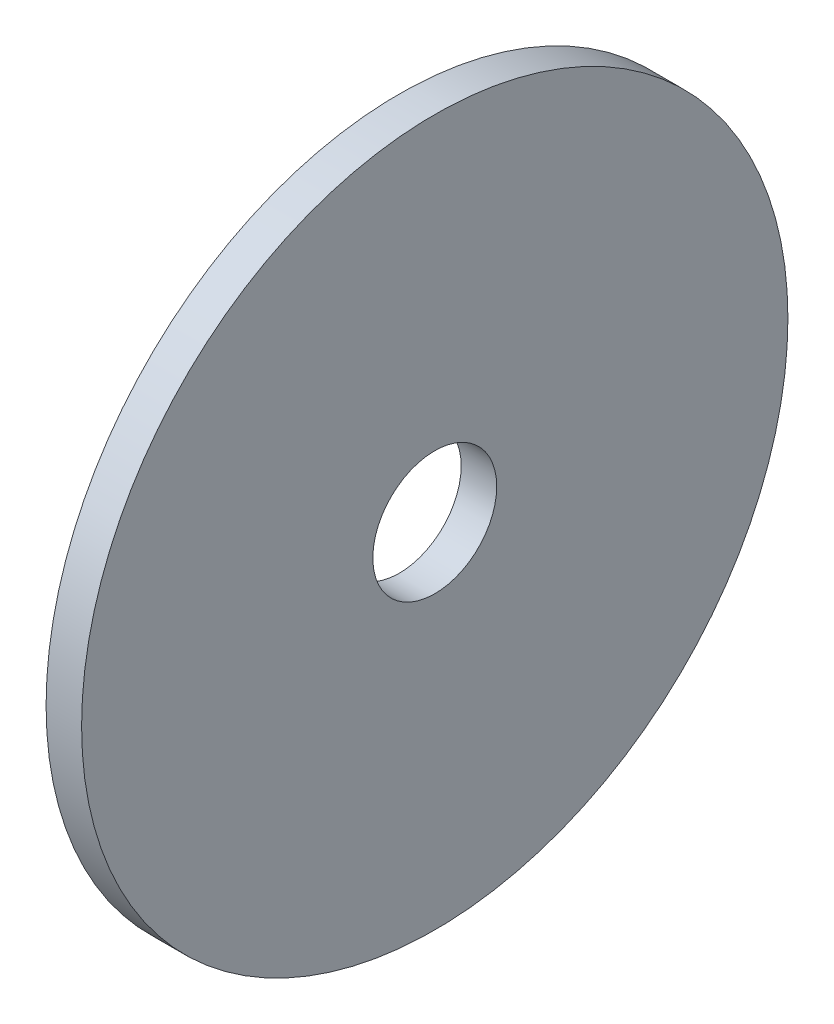
ISO-10303-21;
HEADER;
FILE_DESCRIPTION(('STEP AP214'),'2;1');
FILE_NAME('part.step','',(''),(''),'','','');
FILE_SCHEMA(('AUTOMOTIVE_DESIGN { 1 0 10303 214 1 1 1 1 }'));
ENDSEC;
DATA;
#1=APPLICATION_CONTEXT('core data for automotive mechanical design processes');
#2=APPLICATION_PROTOCOL_DEFINITION('international standard','automotive_design',2000,#1);
#3=PRODUCT_CONTEXT('',#1,'mechanical');
#4=PRODUCT('Part','Part','',(#3));
#5=PRODUCT_RELATED_PRODUCT_CATEGORY('part','',(#4));
#6=PRODUCT_DEFINITION_FORMATION('','',#4);
#7=PRODUCT_DEFINITION_CONTEXT('part definition',#1,'design');
#8=PRODUCT_DEFINITION('design','',#6,#7);
#9=PRODUCT_DEFINITION_SHAPE('','',#8);
#10=(LENGTH_UNIT() NAMED_UNIT(*) SI_UNIT(.MILLI.,.METRE.));
#11=(NAMED_UNIT(*) PLANE_ANGLE_UNIT() SI_UNIT($,.RADIAN.));
#12=(NAMED_UNIT(*) SI_UNIT($,.STERADIAN.) SOLID_ANGLE_UNIT());
#13=UNCERTAINTY_MEASURE_WITH_UNIT(LENGTH_MEASURE(1.E-05),#10,'distance_accuracy_value','');
#14=(GEOMETRIC_REPRESENTATION_CONTEXT(3) GLOBAL_UNCERTAINTY_ASSIGNED_CONTEXT((#13)) GLOBAL_UNIT_ASSIGNED_CONTEXT((#10,
#11,#12)) REPRESENTATION_CONTEXT('',''));
#15=CARTESIAN_POINT('',(0.,0.,0.));
#16=DIRECTION('',(0.,0.,1.));
#17=DIRECTION('',(1.,0.,0.));
#18=AXIS2_PLACEMENT_3D('',#15,#16,#17);
#19=CARTESIAN_POINT('',(509.651,0.,0.));
#20=DIRECTION('',(1.,0.,0.));
#21=DIRECTION('',(0.,0.,-1.));
#22=AXIS2_PLACEMENT_3D('',#19,#20,#21);
#23=PLANE('',#22);
#24=CARTESIAN_POINT('',(509.651,0.,0.));
#25=DIRECTION('',(1.,0.,0.));
#26=DIRECTION('',(0.,0.,-1.));
#27=AXIS2_PLACEMENT_3D('',#24,#25,#26);
#28=CIRCLE('',#27,9.525);
#29=CARTESIAN_POINT('',(509.651,0.,-9.525));
#30=VERTEX_POINT('',#29);
#31=EDGE_CURVE('E59',#30,#30,#28,.T.);
#32=ORIENTED_EDGE('',*,*,#31,.T.);
#33=EDGE_LOOP('',(#32));
#34=FACE_BOUND('',#33,.T.);
#35=CARTESIAN_POINT('',(509.651,0.,0.));
#36=DIRECTION('',(1.,0.,0.));
#37=DIRECTION('',(0.,0.,-1.));
#38=AXIS2_PLACEMENT_3D('',#35,#36,#37);
#39=CIRCLE('',#38,54.303329995861);
#40=CARTESIAN_POINT('',(509.651,0.,-54.303329995861));
#41=VERTEX_POINT('',#40);
#42=EDGE_CURVE('E11',#41,#41,#39,.T.);
#43=ORIENTED_EDGE('',*,*,#42,.F.);
#44=EDGE_LOOP('',(#43));
#45=FACE_BOUND('',#44,.T.);
#46=ADVANCED_FACE('F46',(#34,#45),#23,.F.);
#47=CARTESIAN_POINT('',(509.651,0.,0.));
#48=DIRECTION('',(1.,0.,0.));
#49=DIRECTION('',(0.,0.,-1.));
#50=AXIS2_PLACEMENT_3D('',#47,#48,#49);
#51=CYLINDRICAL_SURFACE('',#50,54.303329995861);
#52=ORIENTED_EDGE('',*,*,#42,.T.);
#53=EDGE_LOOP('',(#52));
#54=FACE_BOUND('',#53,.T.);
#55=CARTESIAN_POINT('',(515.112,0.,0.));
#56=DIRECTION('',(1.,0.,0.));
#57=DIRECTION('',(0.,0.,-1.));
#58=AXIS2_PLACEMENT_3D('',#55,#56,#57);
#59=CIRCLE('',#58,54.303329995861);
#60=CARTESIAN_POINT('',(515.112,0.,-54.303329995861));
#61=VERTEX_POINT('',#60);
#62=EDGE_CURVE('E50',#61,#61,#59,.T.);
#63=ORIENTED_EDGE('',*,*,#62,.F.);
#64=EDGE_LOOP('',(#63));
#65=FACE_BOUND('',#64,.T.);
#66=ADVANCED_FACE('F79',(#54,#65),#51,.T.);
#67=CARTESIAN_POINT('',(515.112,0.,0.));
#68=DIRECTION('',(1.,0.,0.));
#69=DIRECTION('',(0.,0.,-1.));
#70=AXIS2_PLACEMENT_3D('',#67,#68,#69);
#71=PLANE('',#70);
#72=CARTESIAN_POINT('',(515.112,0.,0.));
#73=DIRECTION('',(1.,0.,0.));
#74=DIRECTION('',(0.,0.,-1.));
#75=AXIS2_PLACEMENT_3D('',#72,#73,#74);
#76=CIRCLE('',#75,9.525);
#77=CARTESIAN_POINT('',(515.112,0.,-9.525));
#78=VERTEX_POINT('',#77);
#79=EDGE_CURVE('E61',#78,#78,#76,.T.);
#80=ORIENTED_EDGE('',*,*,#79,.F.);
#81=EDGE_LOOP('',(#80));
#82=FACE_BOUND('',#81,.T.);
#83=ORIENTED_EDGE('',*,*,#62,.T.);
#84=EDGE_LOOP('',(#83));
#85=FACE_BOUND('',#84,.T.);
#86=ADVANCED_FACE('F48',(#82,#85),#71,.T.);
#87=CARTESIAN_POINT('',(509.651,0.,0.));
#88=DIRECTION('',(1.,0.,0.));
#89=DIRECTION('',(0.,0.,-1.));
#90=AXIS2_PLACEMENT_3D('',#87,#88,#89);
#91=CYLINDRICAL_SURFACE('',#90,9.525);
#92=ORIENTED_EDGE('',*,*,#31,.F.);
#93=EDGE_LOOP('',(#92));
#94=FACE_BOUND('',#93,.T.);
#95=ORIENTED_EDGE('',*,*,#79,.T.);
#96=EDGE_LOOP('',(#95));
#97=FACE_BOUND('',#96,.T.);
#98=ADVANCED_FACE('F71',(#94,#97),#91,.F.);
#99=CLOSED_SHELL('',(#46,#66,#86,#98));
#100=MANIFOLD_SOLID_BREP('B2',#99);
#101=ADVANCED_BREP_SHAPE_REPRESENTATION('',(#18,#100),#14);
#102=SHAPE_DEFINITION_REPRESENTATION(#9,#101);
ENDSEC;
END-ISO-10303-21;
